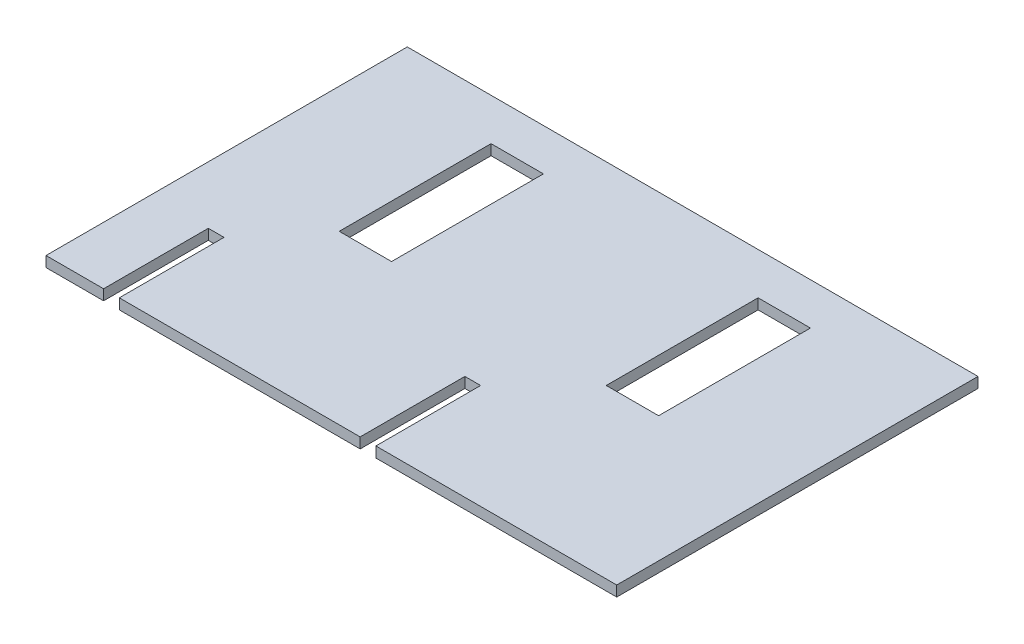
ISO-10303-21;
HEADER;
FILE_DESCRIPTION(('STEP AP214'),'2;1');
FILE_NAME('part.step','',(''),(''),'','','');
FILE_SCHEMA(('AUTOMOTIVE_DESIGN { 1 0 10303 214 1 1 1 1 }'));
ENDSEC;
DATA;
#1=APPLICATION_CONTEXT('core data for automotive mechanical design processes');
#2=APPLICATION_PROTOCOL_DEFINITION('international standard','automotive_design',2000,#1);
#3=PRODUCT_CONTEXT('',#1,'mechanical');
#4=PRODUCT('Part','Part','',(#3));
#5=PRODUCT_RELATED_PRODUCT_CATEGORY('part','',(#4));
#6=PRODUCT_DEFINITION_FORMATION('','',#4);
#7=PRODUCT_DEFINITION_CONTEXT('part definition',#1,'design');
#8=PRODUCT_DEFINITION('design','',#6,#7);
#9=PRODUCT_DEFINITION_SHAPE('','',#8);
#10=(LENGTH_UNIT() NAMED_UNIT(*) SI_UNIT(.MILLI.,.METRE.));
#11=(NAMED_UNIT(*) PLANE_ANGLE_UNIT() SI_UNIT($,.RADIAN.));
#12=(NAMED_UNIT(*) SI_UNIT($,.STERADIAN.) SOLID_ANGLE_UNIT());
#13=UNCERTAINTY_MEASURE_WITH_UNIT(LENGTH_MEASURE(1.E-05),#10,'distance_accuracy_value','');
#14=(GEOMETRIC_REPRESENTATION_CONTEXT(3) GLOBAL_UNCERTAINTY_ASSIGNED_CONTEXT((#13)) GLOBAL_UNIT_ASSIGNED_CONTEXT((#10,
#11,#12)) REPRESENTATION_CONTEXT('',''));
#15=CARTESIAN_POINT('',(0.,0.,0.));
#16=DIRECTION('',(0.,0.,1.));
#17=DIRECTION('',(1.,0.,0.));
#18=AXIS2_PLACEMENT_3D('',#15,#16,#17);
#19=CARTESIAN_POINT('',(-27.25,1.,17.25));
#20=DIRECTION('',(0.,0.,-1.));
#21=DIRECTION('',(-1.,0.,0.));
#22=AXIS2_PLACEMENT_3D('',#19,#20,#21);
#23=PLANE('',#22);
#24=DIRECTION('',(1.,0.,0.));
#25=VECTOR('',#24,1.);
#26=CARTESIAN_POINT('',(-27.25,0.,17.25));
#27=LINE('',#26,#25);
#28=CARTESIAN_POINT('',(-20.25,0.,17.25));
#29=VERTEX_POINT('',#28);
#30=CARTESIAN_POINT('',(2.75,0.,17.25));
#31=VERTEX_POINT('',#30);
#32=EDGE_CURVE('E187',#29,#31,#27,.T.);
#33=ORIENTED_EDGE('',*,*,#32,.T.);
#34=DIRECTION('',(0.,1.,0.));
#35=VECTOR('',#34,1.);
#36=CARTESIAN_POINT('',(2.75,-1.,17.25));
#37=LINE('',#36,#35);
#38=CARTESIAN_POINT('',(2.75,1.,17.25));
#39=VERTEX_POINT('',#38);
#40=EDGE_CURVE('E172',#31,#39,#37,.T.);
#41=ORIENTED_EDGE('',*,*,#40,.T.);
#42=DIRECTION('',(1.,0.,0.));
#43=VECTOR('',#42,1.);
#44=CARTESIAN_POINT('',(-27.25,1.,17.25));
#45=LINE('',#44,#43);
#46=CARTESIAN_POINT('',(-20.25,1.,17.25));
#47=VERTEX_POINT('',#46);
#48=EDGE_CURVE('E185',#47,#39,#45,.T.);
#49=ORIENTED_EDGE('',*,*,#48,.F.);
#50=DIRECTION('',(0.,1.,0.));
#51=VECTOR('',#50,1.);
#52=CARTESIAN_POINT('',(-20.25,-1.,17.25));
#53=LINE('',#52,#51);
#54=EDGE_CURVE('E282',#29,#47,#53,.T.);
#55=ORIENTED_EDGE('',*,*,#54,.F.);
#56=EDGE_LOOP('',(#33,#41,#49,#55));
#57=FACE_BOUND('',#56,.T.);
#58=ADVANCED_FACE('F33',(#57),#23,.F.);
#59=CARTESIAN_POINT('',(-27.25,0.,17.25));
#60=VERTEX_POINT('',#59);
#61=CARTESIAN_POINT('',(-21.75,0.,17.25));
#62=VERTEX_POINT('',#61);
#63=EDGE_CURVE('E214',#60,#62,#27,.T.);
#64=ORIENTED_EDGE('',*,*,#63,.T.);
#65=DIRECTION('',(0.,1.,0.));
#66=VECTOR('',#65,1.);
#67=CARTESIAN_POINT('',(-21.75,-1.,17.25));
#68=LINE('',#67,#66);
#69=CARTESIAN_POINT('',(-21.75,1.,17.25));
#70=VERTEX_POINT('',#69);
#71=EDGE_CURVE('E283',#62,#70,#68,.T.);
#72=ORIENTED_EDGE('',*,*,#71,.T.);
#73=CARTESIAN_POINT('',(-27.25,1.,17.25));
#74=VERTEX_POINT('',#73);
#75=EDGE_CURVE('E196',#74,#70,#45,.T.);
#76=ORIENTED_EDGE('',*,*,#75,.F.);
#77=DIRECTION('',(0.,-1.,0.));
#78=VECTOR('',#77,1.);
#79=CARTESIAN_POINT('',(-27.25,1.,17.25));
#80=LINE('',#79,#78);
#81=EDGE_CURVE('E220',#74,#60,#80,.T.);
#82=ORIENTED_EDGE('',*,*,#81,.T.);
#83=EDGE_LOOP('',(#64,#72,#76,#82));
#84=FACE_BOUND('',#83,.T.);
#85=ADVANCED_FACE('F341',(#84),#23,.F.);
#86=CARTESIAN_POINT('',(27.25,1.,-17.25));
#87=DIRECTION('',(-1.,0.,0.));
#88=DIRECTION('',(0.,0.,1.));
#89=AXIS2_PLACEMENT_3D('',#86,#87,#88);
#90=PLANE('',#89);
#91=DIRECTION('',(0.,0.,-1.));
#92=VECTOR('',#91,1.);
#93=CARTESIAN_POINT('',(27.25,0.,-17.25));
#94=LINE('',#93,#92);
#95=CARTESIAN_POINT('',(27.25,0.,17.25));
#96=VERTEX_POINT('',#95);
#97=CARTESIAN_POINT('',(27.25,0.,-17.25));
#98=VERTEX_POINT('',#97);
#99=EDGE_CURVE('E205',#96,#98,#94,.T.);
#100=ORIENTED_EDGE('',*,*,#99,.T.);
#101=DIRECTION('',(0.,-1.,0.));
#102=VECTOR('',#101,1.);
#103=CARTESIAN_POINT('',(27.25,1.,-17.25));
#104=LINE('',#103,#102);
#105=CARTESIAN_POINT('',(27.25,1.,-17.25));
#106=VERTEX_POINT('',#105);
#107=EDGE_CURVE('E226',#106,#98,#104,.T.);
#108=ORIENTED_EDGE('',*,*,#107,.F.);
#109=DIRECTION('',(0.,0.,-1.));
#110=VECTOR('',#109,1.);
#111=CARTESIAN_POINT('',(27.25,1.,-17.25));
#112=LINE('',#111,#110);
#113=CARTESIAN_POINT('',(27.25,1.,17.25));
#114=VERTEX_POINT('',#113);
#115=EDGE_CURVE('E217',#114,#106,#112,.T.);
#116=ORIENTED_EDGE('',*,*,#115,.F.);
#117=DIRECTION('',(0.,-1.,0.));
#118=VECTOR('',#117,1.);
#119=CARTESIAN_POINT('',(27.25,1.,17.25));
#120=LINE('',#119,#118);
#121=EDGE_CURVE('E200',#114,#96,#120,.T.);
#122=ORIENTED_EDGE('',*,*,#121,.T.);
#123=EDGE_LOOP('',(#100,#108,#116,#122));
#124=FACE_BOUND('',#123,.T.);
#125=ADVANCED_FACE('F35',(#124),#90,.F.);
#126=CARTESIAN_POINT('',(-27.25,1.,-17.25));
#127=DIRECTION('',(0.,0.,1.));
#128=DIRECTION('',(1.,0.,0.));
#129=AXIS2_PLACEMENT_3D('',#126,#127,#128);
#130=PLANE('',#129);
#131=DIRECTION('',(-1.,0.,0.));
#132=VECTOR('',#131,1.);
#133=CARTESIAN_POINT('',(-27.25,0.,-17.25));
#134=LINE('',#133,#132);
#135=CARTESIAN_POINT('',(-27.25,0.,-17.25));
#136=VERTEX_POINT('',#135);
#137=EDGE_CURVE('E208',#98,#136,#134,.T.);
#138=ORIENTED_EDGE('',*,*,#137,.T.);
#139=DIRECTION('',(0.,-1.,0.));
#140=VECTOR('',#139,1.);
#141=CARTESIAN_POINT('',(-27.25,1.,-17.25));
#142=LINE('',#141,#140);
#143=CARTESIAN_POINT('',(-27.25,1.,-17.25));
#144=VERTEX_POINT('',#143);
#145=EDGE_CURVE('E223',#144,#136,#142,.T.);
#146=ORIENTED_EDGE('',*,*,#145,.F.);
#147=DIRECTION('',(-1.,0.,0.));
#148=VECTOR('',#147,1.);
#149=CARTESIAN_POINT('',(-27.25,1.,-17.25));
#150=LINE('',#149,#148);
#151=EDGE_CURVE('E330',#106,#144,#150,.T.);
#152=ORIENTED_EDGE('',*,*,#151,.F.);
#153=ORIENTED_EDGE('',*,*,#107,.T.);
#154=EDGE_LOOP('',(#138,#146,#152,#153));
#155=FACE_BOUND('',#154,.T.);
#156=ADVANCED_FACE('F358',(#155),#130,.F.);
#157=CARTESIAN_POINT('',(-27.25,1.,-17.25));
#158=DIRECTION('',(1.,0.,0.));
#159=DIRECTION('',(0.,0.,-1.));
#160=AXIS2_PLACEMENT_3D('',#157,#158,#159);
#161=PLANE('',#160);
#162=DIRECTION('',(0.,0.,1.));
#163=VECTOR('',#162,1.);
#164=CARTESIAN_POINT('',(-27.25,0.,-17.25));
#165=LINE('',#164,#163);
#166=EDGE_CURVE('E211',#136,#60,#165,.T.);
#167=ORIENTED_EDGE('',*,*,#166,.T.);
#168=ORIENTED_EDGE('',*,*,#81,.F.);
#169=DIRECTION('',(0.,0.,1.));
#170=VECTOR('',#169,1.);
#171=CARTESIAN_POINT('',(-27.25,1.,-17.25));
#172=LINE('',#171,#170);
#173=EDGE_CURVE('E201',#144,#74,#172,.T.);
#174=ORIENTED_EDGE('',*,*,#173,.F.);
#175=ORIENTED_EDGE('',*,*,#145,.T.);
#176=EDGE_LOOP('',(#167,#168,#174,#175));
#177=FACE_BOUND('',#176,.T.);
#178=ADVANCED_FACE('F337',(#177),#161,.F.);
#179=CARTESIAN_POINT('',(4.25,1.,17.25));
#180=VERTEX_POINT('',#179);
#181=EDGE_CURVE('E197',#180,#114,#45,.T.);
#182=ORIENTED_EDGE('',*,*,#181,.F.);
#183=DIRECTION('',(0.,1.,0.));
#184=VECTOR('',#183,1.);
#185=CARTESIAN_POINT('',(4.25,-1.,17.25));
#186=LINE('',#185,#184);
#187=CARTESIAN_POINT('',(4.25,0.,17.25));
#188=VERTEX_POINT('',#187);
#189=EDGE_CURVE('E188',#188,#180,#186,.T.);
#190=ORIENTED_EDGE('',*,*,#189,.F.);
#191=EDGE_CURVE('E213',#188,#96,#27,.T.);
#192=ORIENTED_EDGE('',*,*,#191,.T.);
#193=ORIENTED_EDGE('',*,*,#121,.F.);
#194=EDGE_LOOP('',(#182,#190,#192,#193));
#195=FACE_BOUND('',#194,.T.);
#196=ADVANCED_FACE('F352',(#195),#23,.F.);
#197=CARTESIAN_POINT('',(0.,1.,0.));
#198=DIRECTION('',(0.,1.,0.));
#199=DIRECTION('',(0.,0.,1.));
#200=AXIS2_PLACEMENT_3D('',#197,#198,#199);
#201=PLANE('',#200);
#202=DIRECTION('',(0.,0.,1.));
#203=VECTOR('',#202,1.);
#204=CARTESIAN_POINT('',(2.75,1.,17.25));
#205=LINE('',#204,#203);
#206=CARTESIAN_POINT('',(2.75,1.,7.25));
#207=VERTEX_POINT('',#206);
#208=EDGE_CURVE('E169',#207,#39,#205,.T.);
#209=ORIENTED_EDGE('',*,*,#208,.F.);
#210=DIRECTION('',(-1.,0.,0.));
#211=VECTOR('',#210,1.);
#212=CARTESIAN_POINT('',(2.75,1.,7.25));
#213=LINE('',#212,#211);
#214=CARTESIAN_POINT('',(4.25,1.,7.25));
#215=VERTEX_POINT('',#214);
#216=EDGE_CURVE('E189',#215,#207,#213,.T.);
#217=ORIENTED_EDGE('',*,*,#216,.F.);
#218=DIRECTION('',(0.,0.,-1.));
#219=VECTOR('',#218,1.);
#220=CARTESIAN_POINT('',(4.25,1.,7.25));
#221=LINE('',#220,#219);
#222=EDGE_CURVE('E179',#180,#215,#221,.T.);
#223=ORIENTED_EDGE('',*,*,#222,.F.);
#224=ORIENTED_EDGE('',*,*,#181,.T.);
#225=ORIENTED_EDGE('',*,*,#115,.T.);
#226=ORIENTED_EDGE('',*,*,#151,.T.);
#227=ORIENTED_EDGE('',*,*,#173,.T.);
#228=ORIENTED_EDGE('',*,*,#75,.T.);
#229=DIRECTION('',(0.,0.,1.));
#230=VECTOR('',#229,1.);
#231=CARTESIAN_POINT('',(-21.75,1.,17.25));
#232=LINE('',#231,#230);
#233=CARTESIAN_POINT('',(-21.75,1.,7.25));
#234=VERTEX_POINT('',#233);
#235=EDGE_CURVE('E280',#234,#70,#232,.T.);
#236=ORIENTED_EDGE('',*,*,#235,.F.);
#237=DIRECTION('',(-1.,0.,0.));
#238=VECTOR('',#237,1.);
#239=CARTESIAN_POINT('',(-21.75,1.,7.25));
#240=LINE('',#239,#238);
#241=CARTESIAN_POINT('',(-20.25,1.,7.25));
#242=VERTEX_POINT('',#241);
#243=EDGE_CURVE('E271',#242,#234,#240,.T.);
#244=ORIENTED_EDGE('',*,*,#243,.F.);
#245=DIRECTION('',(0.,0.,-1.));
#246=VECTOR('',#245,1.);
#247=CARTESIAN_POINT('',(-20.25,1.,7.25));
#248=LINE('',#247,#246);
#249=EDGE_CURVE('E195',#47,#242,#248,.T.);
#250=ORIENTED_EDGE('',*,*,#249,.F.);
#251=ORIENTED_EDGE('',*,*,#48,.T.);
#252=EDGE_LOOP('',(#209,#217,#223,#224,#225,#226,#227,#228,#236,#244,#250,#251));
#253=FACE_BOUND('',#252,.T.);
#254=DIRECTION('',(0.,0.,-1.));
#255=VECTOR('',#254,1.);
#256=CARTESIAN_POINT('',(15.25,1.,-13.25));
#257=LINE('',#256,#255);
#258=CARTESIAN_POINT('',(15.25,1.,1.25));
#259=VERTEX_POINT('',#258);
#260=CARTESIAN_POINT('',(15.25,1.,-13.25));
#261=VERTEX_POINT('',#260);
#262=EDGE_CURVE('E286',#259,#261,#257,.T.);
#263=ORIENTED_EDGE('',*,*,#262,.F.);
#264=DIRECTION('',(1.,0.,0.));
#265=VECTOR('',#264,1.);
#266=CARTESIAN_POINT('',(10.25,1.,1.25));
#267=LINE('',#266,#265);
#268=CARTESIAN_POINT('',(10.25,1.,1.25));
#269=VERTEX_POINT('',#268);
#270=EDGE_CURVE('E298',#269,#259,#267,.T.);
#271=ORIENTED_EDGE('',*,*,#270,.F.);
#272=DIRECTION('',(0.,0.,1.));
#273=VECTOR('',#272,1.);
#274=CARTESIAN_POINT('',(10.25,1.,-13.25));
#275=LINE('',#274,#273);
#276=CARTESIAN_POINT('',(10.25,1.,-13.25));
#277=VERTEX_POINT('',#276);
#278=EDGE_CURVE('E295',#277,#269,#275,.T.);
#279=ORIENTED_EDGE('',*,*,#278,.F.);
#280=DIRECTION('',(-1.,0.,0.));
#281=VECTOR('',#280,1.);
#282=CARTESIAN_POINT('',(10.25,1.,-13.25));
#283=LINE('',#282,#281);
#284=EDGE_CURVE('E292',#261,#277,#283,.T.);
#285=ORIENTED_EDGE('',*,*,#284,.F.);
#286=EDGE_LOOP('',(#263,#271,#279,#285));
#287=FACE_BOUND('',#286,.T.);
#288=DIRECTION('',(0.,0.,-1.));
#289=VECTOR('',#288,1.);
#290=CARTESIAN_POINT('',(-10.25,1.,-13.25));
#291=LINE('',#290,#289);
#292=CARTESIAN_POINT('',(-10.25,1.,1.25));
#293=VERTEX_POINT('',#292);
#294=CARTESIAN_POINT('',(-10.25,1.,-13.25));
#295=VERTEX_POINT('',#294);
#296=EDGE_CURVE('E304',#293,#295,#291,.T.);
#297=ORIENTED_EDGE('',*,*,#296,.F.);
#298=DIRECTION('',(1.,0.,0.));
#299=VECTOR('',#298,1.);
#300=CARTESIAN_POINT('',(-15.25,1.,1.25));
#301=LINE('',#300,#299);
#302=CARTESIAN_POINT('',(-15.25,1.,1.25));
#303=VERTEX_POINT('',#302);
#304=EDGE_CURVE('E318',#303,#293,#301,.T.);
#305=ORIENTED_EDGE('',*,*,#304,.F.);
#306=DIRECTION('',(0.,0.,1.));
#307=VECTOR('',#306,1.);
#308=CARTESIAN_POINT('',(-15.25,1.,-13.25));
#309=LINE('',#308,#307);
#310=CARTESIAN_POINT('',(-15.25,1.,-13.25));
#311=VERTEX_POINT('',#310);
#312=EDGE_CURVE('E315',#311,#303,#309,.T.);
#313=ORIENTED_EDGE('',*,*,#312,.F.);
#314=DIRECTION('',(-1.,0.,0.));
#315=VECTOR('',#314,1.);
#316=CARTESIAN_POINT('',(-15.25,1.,-13.25));
#317=LINE('',#316,#315);
#318=EDGE_CURVE('E312',#295,#311,#317,.T.);
#319=ORIENTED_EDGE('',*,*,#318,.F.);
#320=EDGE_LOOP('',(#297,#305,#313,#319));
#321=FACE_BOUND('',#320,.T.);
#322=ADVANCED_FACE('F192',(#253,#287,#321),#201,.T.);
#323=CARTESIAN_POINT('',(0.,0.,0.));
#324=DIRECTION('',(0.,1.,0.));
#325=DIRECTION('',(0.,0.,1.));
#326=AXIS2_PLACEMENT_3D('',#323,#324,#325);
#327=PLANE('',#326);
#328=DIRECTION('',(1.,0.,0.));
#329=VECTOR('',#328,1.);
#330=CARTESIAN_POINT('',(0.,0.,1.25));
#331=LINE('',#330,#329);
#332=CARTESIAN_POINT('',(10.25,0.,1.25));
#333=VERTEX_POINT('',#332);
#334=CARTESIAN_POINT('',(15.25,0.,1.25));
#335=VERTEX_POINT('',#334);
#336=EDGE_CURVE('E247',#333,#335,#331,.T.);
#337=ORIENTED_EDGE('',*,*,#336,.T.);
#338=DIRECTION('',(0.,0.,-1.));
#339=VECTOR('',#338,1.);
#340=CARTESIAN_POINT('',(15.25,0.,0.));
#341=LINE('',#340,#339);
#342=CARTESIAN_POINT('',(15.25,0.,-13.25));
#343=VERTEX_POINT('',#342);
#344=EDGE_CURVE('E250',#335,#343,#341,.T.);
#345=ORIENTED_EDGE('',*,*,#344,.T.);
#346=DIRECTION('',(-1.,0.,0.));
#347=VECTOR('',#346,1.);
#348=CARTESIAN_POINT('',(0.,0.,-13.25));
#349=LINE('',#348,#347);
#350=CARTESIAN_POINT('',(10.25,0.,-13.25));
#351=VERTEX_POINT('',#350);
#352=EDGE_CURVE('E241',#343,#351,#349,.T.);
#353=ORIENTED_EDGE('',*,*,#352,.T.);
#354=DIRECTION('',(0.,0.,1.));
#355=VECTOR('',#354,1.);
#356=CARTESIAN_POINT('',(10.25,0.,0.));
#357=LINE('',#356,#355);
#358=EDGE_CURVE('E244',#351,#333,#357,.T.);
#359=ORIENTED_EDGE('',*,*,#358,.T.);
#360=EDGE_LOOP('',(#337,#345,#353,#359));
#361=FACE_BOUND('',#360,.T.);
#362=DIRECTION('',(1.,0.,0.));
#363=VECTOR('',#362,1.);
#364=CARTESIAN_POINT('',(0.,0.,1.25));
#365=LINE('',#364,#363);
#366=CARTESIAN_POINT('',(-15.25,0.,1.25));
#367=VERTEX_POINT('',#366);
#368=CARTESIAN_POINT('',(-10.25,0.,1.25));
#369=VERTEX_POINT('',#368);
#370=EDGE_CURVE('E235',#367,#369,#365,.T.);
#371=ORIENTED_EDGE('',*,*,#370,.T.);
#372=DIRECTION('',(0.,0.,-1.));
#373=VECTOR('',#372,1.);
#374=CARTESIAN_POINT('',(-10.25,0.,0.));
#375=LINE('',#374,#373);
#376=CARTESIAN_POINT('',(-10.25,0.,-13.25));
#377=VERTEX_POINT('',#376);
#378=EDGE_CURVE('E238',#369,#377,#375,.T.);
#379=ORIENTED_EDGE('',*,*,#378,.T.);
#380=DIRECTION('',(-1.,0.,0.));
#381=VECTOR('',#380,1.);
#382=CARTESIAN_POINT('',(0.,0.,-13.25));
#383=LINE('',#382,#381);
#384=CARTESIAN_POINT('',(-15.25,0.,-13.25));
#385=VERTEX_POINT('',#384);
#386=EDGE_CURVE('E229',#377,#385,#383,.T.);
#387=ORIENTED_EDGE('',*,*,#386,.T.);
#388=DIRECTION('',(0.,0.,1.));
#389=VECTOR('',#388,1.);
#390=CARTESIAN_POINT('',(-15.25,0.,0.));
#391=LINE('',#390,#389);
#392=EDGE_CURVE('E232',#385,#367,#391,.T.);
#393=ORIENTED_EDGE('',*,*,#392,.T.);
#394=EDGE_LOOP('',(#371,#379,#387,#393));
#395=FACE_BOUND('',#394,.T.);
#396=DIRECTION('',(-1.,0.,0.));
#397=VECTOR('',#396,1.);
#398=CARTESIAN_POINT('',(0.,0.,7.25));
#399=LINE('',#398,#397);
#400=CARTESIAN_POINT('',(4.25,0.,7.25));
#401=VERTEX_POINT('',#400);
#402=CARTESIAN_POINT('',(2.75,0.,7.25));
#403=VERTEX_POINT('',#402);
#404=EDGE_CURVE('E41',#401,#403,#399,.T.);
#405=ORIENTED_EDGE('',*,*,#404,.T.);
#406=DIRECTION('',(0.,0.,1.));
#407=VECTOR('',#406,1.);
#408=CARTESIAN_POINT('',(2.75,0.,0.));
#409=LINE('',#408,#407);
#410=EDGE_CURVE('E11',#403,#31,#409,.T.);
#411=ORIENTED_EDGE('',*,*,#410,.T.);
#412=ORIENTED_EDGE('',*,*,#32,.F.);
#413=DIRECTION('',(0.,0.,-1.));
#414=VECTOR('',#413,1.);
#415=CARTESIAN_POINT('',(-20.25,0.,0.));
#416=LINE('',#415,#414);
#417=CARTESIAN_POINT('',(-20.25,0.,7.25));
#418=VERTEX_POINT('',#417);
#419=EDGE_CURVE('E253',#29,#418,#416,.T.);
#420=ORIENTED_EDGE('',*,*,#419,.T.);
#421=DIRECTION('',(-1.,0.,0.));
#422=VECTOR('',#421,1.);
#423=CARTESIAN_POINT('',(0.,0.,7.25));
#424=LINE('',#423,#422);
#425=CARTESIAN_POINT('',(-21.75,0.,7.25));
#426=VERTEX_POINT('',#425);
#427=EDGE_CURVE('E256',#418,#426,#424,.T.);
#428=ORIENTED_EDGE('',*,*,#427,.T.);
#429=DIRECTION('',(0.,0.,1.));
#430=VECTOR('',#429,1.);
#431=CARTESIAN_POINT('',(-21.75,0.,0.));
#432=LINE('',#431,#430);
#433=EDGE_CURVE('E259',#426,#62,#432,.T.);
#434=ORIENTED_EDGE('',*,*,#433,.T.);
#435=ORIENTED_EDGE('',*,*,#63,.F.);
#436=ORIENTED_EDGE('',*,*,#166,.F.);
#437=ORIENTED_EDGE('',*,*,#137,.F.);
#438=ORIENTED_EDGE('',*,*,#99,.F.);
#439=ORIENTED_EDGE('',*,*,#191,.F.);
#440=DIRECTION('',(0.,0.,-1.));
#441=VECTOR('',#440,1.);
#442=CARTESIAN_POINT('',(4.25,0.,0.));
#443=LINE('',#442,#441);
#444=EDGE_CURVE('E262',#188,#401,#443,.T.);
#445=ORIENTED_EDGE('',*,*,#444,.T.);
#446=EDGE_LOOP('',(#405,#411,#412,#420,#428,#434,#435,#436,#437,#438,#439,#445));
#447=FACE_BOUND('',#446,.T.);
#448=ADVANCED_FACE('F266',(#361,#395,#447),#327,.F.);
#449=CARTESIAN_POINT('',(-10.25,-1.,-13.25));
#450=DIRECTION('',(1.,0.,0.));
#451=DIRECTION('',(0.,0.,-1.));
#452=AXIS2_PLACEMENT_3D('',#449,#450,#451);
#453=PLANE('',#452);
#454=DIRECTION('',(0.,1.,0.));
#455=VECTOR('',#454,1.);
#456=CARTESIAN_POINT('',(-10.25,-1.,1.25));
#457=LINE('',#456,#455);
#458=EDGE_CURVE('E209',#369,#293,#457,.T.);
#459=ORIENTED_EDGE('',*,*,#458,.T.);
#460=ORIENTED_EDGE('',*,*,#296,.T.);
#461=DIRECTION('',(0.,1.,0.));
#462=VECTOR('',#461,1.);
#463=CARTESIAN_POINT('',(-10.25,-1.,-13.25));
#464=LINE('',#463,#462);
#465=EDGE_CURVE('E321',#377,#295,#464,.T.);
#466=ORIENTED_EDGE('',*,*,#465,.F.);
#467=ORIENTED_EDGE('',*,*,#378,.F.);
#468=EDGE_LOOP('',(#459,#460,#466,#467));
#469=FACE_BOUND('',#468,.T.);
#470=ADVANCED_FACE('F449',(#469),#453,.F.);
#471=CARTESIAN_POINT('',(-15.25,-1.,1.25));
#472=DIRECTION('',(0.,0.,1.));
#473=DIRECTION('',(1.,0.,0.));
#474=AXIS2_PLACEMENT_3D('',#471,#472,#473);
#475=PLANE('',#474);
#476=DIRECTION('',(0.,1.,0.));
#477=VECTOR('',#476,1.);
#478=CARTESIAN_POINT('',(-15.25,-1.,1.25));
#479=LINE('',#478,#477);
#480=EDGE_CURVE('E323',#367,#303,#479,.T.);
#481=ORIENTED_EDGE('',*,*,#480,.T.);
#482=ORIENTED_EDGE('',*,*,#304,.T.);
#483=ORIENTED_EDGE('',*,*,#458,.F.);
#484=ORIENTED_EDGE('',*,*,#370,.F.);
#485=EDGE_LOOP('',(#481,#482,#483,#484));
#486=FACE_BOUND('',#485,.T.);
#487=ADVANCED_FACE('F486',(#486),#475,.F.);
#488=CARTESIAN_POINT('',(-15.25,-1.,-13.25));
#489=DIRECTION('',(-1.,0.,0.));
#490=DIRECTION('',(0.,0.,1.));
#491=AXIS2_PLACEMENT_3D('',#488,#489,#490);
#492=PLANE('',#491);
#493=DIRECTION('',(0.,1.,0.));
#494=VECTOR('',#493,1.);
#495=CARTESIAN_POINT('',(-15.25,-1.,-13.25));
#496=LINE('',#495,#494);
#497=EDGE_CURVE('E325',#385,#311,#496,.T.);
#498=ORIENTED_EDGE('',*,*,#497,.T.);
#499=ORIENTED_EDGE('',*,*,#312,.T.);
#500=ORIENTED_EDGE('',*,*,#480,.F.);
#501=ORIENTED_EDGE('',*,*,#392,.F.);
#502=EDGE_LOOP('',(#498,#499,#500,#501));
#503=FACE_BOUND('',#502,.T.);
#504=ADVANCED_FACE('F489',(#503),#492,.F.);
#505=CARTESIAN_POINT('',(-15.25,-1.,-13.25));
#506=DIRECTION('',(0.,0.,-1.));
#507=DIRECTION('',(-1.,0.,0.));
#508=AXIS2_PLACEMENT_3D('',#505,#506,#507);
#509=PLANE('',#508);
#510=ORIENTED_EDGE('',*,*,#465,.T.);
#511=ORIENTED_EDGE('',*,*,#318,.T.);
#512=ORIENTED_EDGE('',*,*,#497,.F.);
#513=ORIENTED_EDGE('',*,*,#386,.F.);
#514=EDGE_LOOP('',(#510,#511,#512,#513));
#515=FACE_BOUND('',#514,.T.);
#516=ADVANCED_FACE('F484',(#515),#509,.F.);
#517=CARTESIAN_POINT('',(15.25,-1.,-13.25));
#518=DIRECTION('',(1.,0.,0.));
#519=DIRECTION('',(0.,0.,-1.));
#520=AXIS2_PLACEMENT_3D('',#517,#518,#519);
#521=PLANE('',#520);
#522=DIRECTION('',(0.,1.,0.));
#523=VECTOR('',#522,1.);
#524=CARTESIAN_POINT('',(15.25,-1.,1.25));
#525=LINE('',#524,#523);
#526=EDGE_CURVE('E302',#335,#259,#525,.T.);
#527=ORIENTED_EDGE('',*,*,#526,.T.);
#528=ORIENTED_EDGE('',*,*,#262,.T.);
#529=DIRECTION('',(0.,1.,0.));
#530=VECTOR('',#529,1.);
#531=CARTESIAN_POINT('',(15.25,-1.,-13.25));
#532=LINE('',#531,#530);
#533=EDGE_CURVE('E301',#343,#261,#532,.T.);
#534=ORIENTED_EDGE('',*,*,#533,.F.);
#535=ORIENTED_EDGE('',*,*,#344,.F.);
#536=EDGE_LOOP('',(#527,#528,#534,#535));
#537=FACE_BOUND('',#536,.T.);
#538=ADVANCED_FACE('F475',(#537),#521,.F.);
#539=CARTESIAN_POINT('',(10.25,-1.,1.25));
#540=DIRECTION('',(0.,0.,1.));
#541=DIRECTION('',(1.,0.,0.));
#542=AXIS2_PLACEMENT_3D('',#539,#540,#541);
#543=PLANE('',#542);
#544=DIRECTION('',(0.,1.,0.));
#545=VECTOR('',#544,1.);
#546=CARTESIAN_POINT('',(10.25,-1.,1.25));
#547=LINE('',#546,#545);
#548=EDGE_CURVE('E305',#333,#269,#547,.T.);
#549=ORIENTED_EDGE('',*,*,#548,.T.);
#550=ORIENTED_EDGE('',*,*,#270,.T.);
#551=ORIENTED_EDGE('',*,*,#526,.F.);
#552=ORIENTED_EDGE('',*,*,#336,.F.);
#553=EDGE_LOOP('',(#549,#550,#551,#552));
#554=FACE_BOUND('',#553,.T.);
#555=ADVANCED_FACE('F471',(#554),#543,.F.);
#556=CARTESIAN_POINT('',(10.25,-1.,-13.25));
#557=DIRECTION('',(-1.,0.,0.));
#558=DIRECTION('',(0.,0.,1.));
#559=AXIS2_PLACEMENT_3D('',#556,#557,#558);
#560=PLANE('',#559);
#561=DIRECTION('',(0.,1.,0.));
#562=VECTOR('',#561,1.);
#563=CARTESIAN_POINT('',(10.25,-1.,-13.25));
#564=LINE('',#563,#562);
#565=EDGE_CURVE('E307',#351,#277,#564,.T.);
#566=ORIENTED_EDGE('',*,*,#565,.T.);
#567=ORIENTED_EDGE('',*,*,#278,.T.);
#568=ORIENTED_EDGE('',*,*,#548,.F.);
#569=ORIENTED_EDGE('',*,*,#358,.F.);
#570=EDGE_LOOP('',(#566,#567,#568,#569));
#571=FACE_BOUND('',#570,.T.);
#572=ADVANCED_FACE('F474',(#571),#560,.F.);
#573=CARTESIAN_POINT('',(10.25,-1.,-13.25));
#574=DIRECTION('',(0.,0.,-1.));
#575=DIRECTION('',(-1.,0.,0.));
#576=AXIS2_PLACEMENT_3D('',#573,#574,#575);
#577=PLANE('',#576);
#578=ORIENTED_EDGE('',*,*,#533,.T.);
#579=ORIENTED_EDGE('',*,*,#284,.T.);
#580=ORIENTED_EDGE('',*,*,#565,.F.);
#581=ORIENTED_EDGE('',*,*,#352,.F.);
#582=EDGE_LOOP('',(#578,#579,#580,#581));
#583=FACE_BOUND('',#582,.T.);
#584=ADVANCED_FACE('F401',(#583),#577,.F.);
#585=CARTESIAN_POINT('',(-21.75,-1.,17.25));
#586=DIRECTION('',(-1.,0.,0.));
#587=DIRECTION('',(0.,0.,1.));
#588=AXIS2_PLACEMENT_3D('',#585,#586,#587);
#589=PLANE('',#588);
#590=DIRECTION('',(0.,1.,0.));
#591=VECTOR('',#590,1.);
#592=CARTESIAN_POINT('',(-21.75,-1.,7.25));
#593=LINE('',#592,#591);
#594=EDGE_CURVE('E287',#426,#234,#593,.T.);
#595=ORIENTED_EDGE('',*,*,#594,.T.);
#596=ORIENTED_EDGE('',*,*,#235,.T.);
#597=ORIENTED_EDGE('',*,*,#71,.F.);
#598=ORIENTED_EDGE('',*,*,#433,.F.);
#599=EDGE_LOOP('',(#595,#596,#597,#598));
#600=FACE_BOUND('',#599,.T.);
#601=ADVANCED_FACE('F343',(#600),#589,.F.);
#602=CARTESIAN_POINT('',(-21.75,-1.,7.25));
#603=DIRECTION('',(0.,0.,-1.));
#604=DIRECTION('',(-1.,0.,0.));
#605=AXIS2_PLACEMENT_3D('',#602,#603,#604);
#606=PLANE('',#605);
#607=DIRECTION('',(0.,1.,0.));
#608=VECTOR('',#607,1.);
#609=CARTESIAN_POINT('',(-20.25,-1.,7.25));
#610=LINE('',#609,#608);
#611=EDGE_CURVE('E56',#418,#242,#610,.T.);
#612=ORIENTED_EDGE('',*,*,#611,.T.);
#613=ORIENTED_EDGE('',*,*,#243,.T.);
#614=ORIENTED_EDGE('',*,*,#594,.F.);
#615=ORIENTED_EDGE('',*,*,#427,.F.);
#616=EDGE_LOOP('',(#612,#613,#614,#615));
#617=FACE_BOUND('',#616,.T.);
#618=ADVANCED_FACE('F346',(#617),#606,.F.);
#619=CARTESIAN_POINT('',(-20.25,-1.,7.25));
#620=DIRECTION('',(1.,0.,0.));
#621=DIRECTION('',(0.,0.,-1.));
#622=AXIS2_PLACEMENT_3D('',#619,#620,#621);
#623=PLANE('',#622);
#624=ORIENTED_EDGE('',*,*,#54,.T.);
#625=ORIENTED_EDGE('',*,*,#249,.T.);
#626=ORIENTED_EDGE('',*,*,#611,.F.);
#627=ORIENTED_EDGE('',*,*,#419,.F.);
#628=EDGE_LOOP('',(#624,#625,#626,#627));
#629=FACE_BOUND('',#628,.T.);
#630=ADVANCED_FACE('F347',(#629),#623,.F.);
#631=CARTESIAN_POINT('',(2.75,-1.,17.25));
#632=DIRECTION('',(-1.,0.,0.));
#633=DIRECTION('',(0.,0.,1.));
#634=AXIS2_PLACEMENT_3D('',#631,#632,#633);
#635=PLANE('',#634);
#636=DIRECTION('',(0.,1.,0.));
#637=VECTOR('',#636,1.);
#638=CARTESIAN_POINT('',(2.75,-1.,7.25));
#639=LINE('',#638,#637);
#640=EDGE_CURVE('E174',#403,#207,#639,.T.);
#641=ORIENTED_EDGE('',*,*,#640,.T.);
#642=ORIENTED_EDGE('',*,*,#208,.T.);
#643=ORIENTED_EDGE('',*,*,#40,.F.);
#644=ORIENTED_EDGE('',*,*,#410,.F.);
#645=EDGE_LOOP('',(#641,#642,#643,#644));
#646=FACE_BOUND('',#645,.T.);
#647=ADVANCED_FACE('F171',(#646),#635,.F.);
#648=CARTESIAN_POINT('',(2.75,-1.,7.25));
#649=DIRECTION('',(0.,0.,-1.));
#650=DIRECTION('',(-1.,0.,0.));
#651=AXIS2_PLACEMENT_3D('',#648,#649,#650);
#652=PLANE('',#651);
#653=DIRECTION('',(0.,1.,0.));
#654=VECTOR('',#653,1.);
#655=CARTESIAN_POINT('',(4.25,-1.,7.25));
#656=LINE('',#655,#654);
#657=EDGE_CURVE('E48',#401,#215,#656,.T.);
#658=ORIENTED_EDGE('',*,*,#657,.T.);
#659=ORIENTED_EDGE('',*,*,#216,.T.);
#660=ORIENTED_EDGE('',*,*,#640,.F.);
#661=ORIENTED_EDGE('',*,*,#404,.F.);
#662=EDGE_LOOP('',(#658,#659,#660,#661));
#663=FACE_BOUND('',#662,.T.);
#664=ADVANCED_FACE('F269',(#663),#652,.F.);
#665=CARTESIAN_POINT('',(4.25,-1.,7.25));
#666=DIRECTION('',(1.,0.,0.));
#667=DIRECTION('',(0.,0.,-1.));
#668=AXIS2_PLACEMENT_3D('',#665,#666,#667);
#669=PLANE('',#668);
#670=ORIENTED_EDGE('',*,*,#189,.T.);
#671=ORIENTED_EDGE('',*,*,#222,.T.);
#672=ORIENTED_EDGE('',*,*,#657,.F.);
#673=ORIENTED_EDGE('',*,*,#444,.F.);
#674=EDGE_LOOP('',(#670,#671,#672,#673));
#675=FACE_BOUND('',#674,.T.);
#676=ADVANCED_FACE('F360',(#675),#669,.F.);
#677=CLOSED_SHELL('',(#58,#85,#125,#156,#178,#196,#322,#448,#470,#487,#504,#516,#538,#555,#572,
#584,#601,#618,#630,#647,#664,#676));
#678=MANIFOLD_SOLID_BREP('B2',#677);
#679=ADVANCED_BREP_SHAPE_REPRESENTATION('',(#18,#678),#14);
#680=SHAPE_DEFINITION_REPRESENTATION(#9,#679);
ENDSEC;
END-ISO-10303-21;
